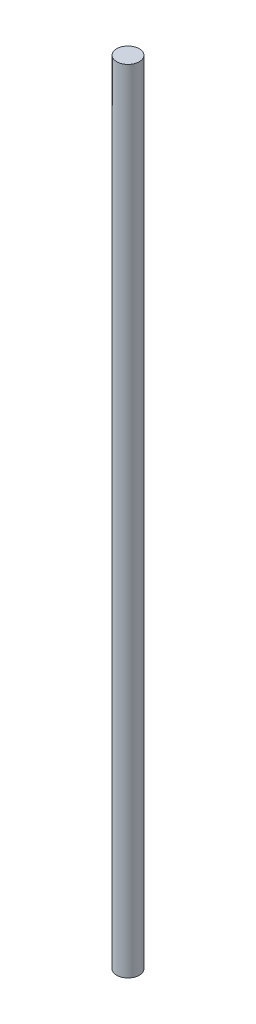
ISO-10303-21;
HEADER;
FILE_DESCRIPTION(('STEP AP214'),'2;1');
FILE_NAME('part.step','',(''),(''),'','','');
FILE_SCHEMA(('AUTOMOTIVE_DESIGN { 1 0 10303 214 1 1 1 1 }'));
ENDSEC;
DATA;
#1=APPLICATION_CONTEXT('core data for automotive mechanical design processes');
#2=APPLICATION_PROTOCOL_DEFINITION('international standard','automotive_design',2000,#1);
#3=PRODUCT_CONTEXT('',#1,'mechanical');
#4=PRODUCT('Part','Part','',(#3));
#5=PRODUCT_RELATED_PRODUCT_CATEGORY('part','',(#4));
#6=PRODUCT_DEFINITION_FORMATION('','',#4);
#7=PRODUCT_DEFINITION_CONTEXT('part definition',#1,'design');
#8=PRODUCT_DEFINITION('design','',#6,#7);
#9=PRODUCT_DEFINITION_SHAPE('','',#8);
#10=(LENGTH_UNIT() NAMED_UNIT(*) SI_UNIT(.MILLI.,.METRE.));
#11=(NAMED_UNIT(*) PLANE_ANGLE_UNIT() SI_UNIT($,.RADIAN.));
#12=(NAMED_UNIT(*) SI_UNIT($,.STERADIAN.) SOLID_ANGLE_UNIT());
#13=UNCERTAINTY_MEASURE_WITH_UNIT(LENGTH_MEASURE(1.E-05),#10,'distance_accuracy_value','');
#14=(GEOMETRIC_REPRESENTATION_CONTEXT(3) GLOBAL_UNCERTAINTY_ASSIGNED_CONTEXT((#13)) GLOBAL_UNIT_ASSIGNED_CONTEXT((#10,
#11,#12)) REPRESENTATION_CONTEXT('',''));
#15=CARTESIAN_POINT('',(0.,0.,0.));
#16=DIRECTION('',(0.,0.,1.));
#17=DIRECTION('',(1.,0.,0.));
#18=AXIS2_PLACEMENT_3D('',#15,#16,#17);
#19=CARTESIAN_POINT('',(0.,140.25,0.));
#20=DIRECTION('',(0.,-1.,0.));
#21=DIRECTION('',(0.,0.,-1.));
#22=AXIS2_PLACEMENT_3D('',#19,#20,#21);
#23=CYLINDRICAL_SURFACE('',#22,4.);
#24=CARTESIAN_POINT('',(0.,140.25,0.));
#25=DIRECTION('',(0.,1.,0.));
#26=DIRECTION('',(0.,0.,1.));
#27=AXIS2_PLACEMENT_3D('',#24,#25,#26);
#28=CIRCLE('',#27,4.);
#29=CARTESIAN_POINT('',(0.,140.25,4.));
#30=VERTEX_POINT('',#29);
#31=EDGE_CURVE('E10',#30,#30,#28,.T.);
#32=ORIENTED_EDGE('',*,*,#31,.F.);
#33=EDGE_LOOP('',(#32));
#34=FACE_BOUND('',#33,.T.);
#35=CARTESIAN_POINT('',(0.,-140.25,0.));
#36=DIRECTION('',(0.,1.,0.));
#37=DIRECTION('',(0.,0.,1.));
#38=AXIS2_PLACEMENT_3D('',#35,#36,#37);
#39=CIRCLE('',#38,4.);
#40=CARTESIAN_POINT('',(0.,-140.25,4.));
#41=VERTEX_POINT('',#40);
#42=EDGE_CURVE('E40',#41,#41,#39,.T.);
#43=ORIENTED_EDGE('',*,*,#42,.T.);
#44=EDGE_LOOP('',(#43));
#45=FACE_BOUND('',#44,.T.);
#46=ADVANCED_FACE('F37',(#34,#45),#23,.T.);
#47=CARTESIAN_POINT('',(0.,140.25,0.));
#48=DIRECTION('',(0.,1.,0.));
#49=DIRECTION('',(0.,0.,1.));
#50=AXIS2_PLACEMENT_3D('',#47,#48,#49);
#51=PLANE('',#50);
#52=ORIENTED_EDGE('',*,*,#31,.T.);
#53=EDGE_LOOP('',(#52));
#54=FACE_BOUND('',#53,.T.);
#55=ADVANCED_FACE('F54',(#54),#51,.T.);
#56=CARTESIAN_POINT('',(0.,-140.25,0.));
#57=DIRECTION('',(0.,1.,0.));
#58=DIRECTION('',(0.,0.,1.));
#59=AXIS2_PLACEMENT_3D('',#56,#57,#58);
#60=PLANE('',#59);
#61=ORIENTED_EDGE('',*,*,#42,.F.);
#62=EDGE_LOOP('',(#61));
#63=FACE_BOUND('',#62,.T.);
#64=ADVANCED_FACE('F52',(#63),#60,.F.);
#65=CLOSED_SHELL('',(#46,#55,#64));
#66=MANIFOLD_SOLID_BREP('B2',#65);
#67=ADVANCED_BREP_SHAPE_REPRESENTATION('',(#18,#66),#14);
#68=SHAPE_DEFINITION_REPRESENTATION(#9,#67);
ENDSEC;
END-ISO-10303-21;
